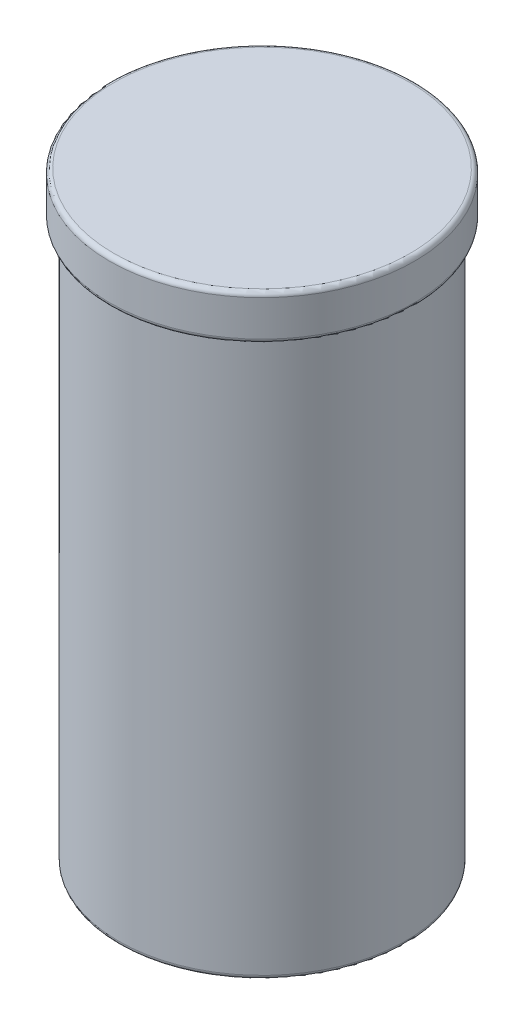
ISO-10303-21;
HEADER;
FILE_DESCRIPTION(('STEP AP214'),'2;1');
FILE_NAME('part.step','',(''),(''),'','','');
FILE_SCHEMA(('AUTOMOTIVE_DESIGN { 1 0 10303 214 1 1 1 1 }'));
ENDSEC;
DATA;
#1=APPLICATION_CONTEXT('core data for automotive mechanical design processes');
#2=APPLICATION_PROTOCOL_DEFINITION('international standard','automotive_design',2000,#1);
#3=PRODUCT_CONTEXT('',#1,'mechanical');
#4=PRODUCT('Part','Part','',(#3));
#5=PRODUCT_RELATED_PRODUCT_CATEGORY('part','',(#4));
#6=PRODUCT_DEFINITION_FORMATION('','',#4);
#7=PRODUCT_DEFINITION_CONTEXT('part definition',#1,'design');
#8=PRODUCT_DEFINITION('design','',#6,#7);
#9=PRODUCT_DEFINITION_SHAPE('','',#8);
#10=(LENGTH_UNIT() NAMED_UNIT(*) SI_UNIT(.MILLI.,.METRE.));
#11=(NAMED_UNIT(*) PLANE_ANGLE_UNIT() SI_UNIT($,.RADIAN.));
#12=(NAMED_UNIT(*) SI_UNIT($,.STERADIAN.) SOLID_ANGLE_UNIT());
#13=UNCERTAINTY_MEASURE_WITH_UNIT(LENGTH_MEASURE(1.E-05),#10,'distance_accuracy_value','');
#14=(GEOMETRIC_REPRESENTATION_CONTEXT(3) GLOBAL_UNCERTAINTY_ASSIGNED_CONTEXT((#13)) GLOBAL_UNIT_ASSIGNED_CONTEXT((#10,
#11,#12)) REPRESENTATION_CONTEXT('',''));
#15=CARTESIAN_POINT('',(0.,0.,0.));
#16=DIRECTION('',(0.,0.,1.));
#17=DIRECTION('',(1.,0.,0.));
#18=AXIS2_PLACEMENT_3D('',#15,#16,#17);
#19=CARTESIAN_POINT('',(0.,67.12,0.));
#20=DIRECTION('',(0.,-1.,0.));
#21=DIRECTION('',(0.,0.,-1.));
#22=AXIS2_PLACEMENT_3D('',#19,#20,#21);
#23=CYLINDRICAL_SURFACE('',#22,16.);
#24=CARTESIAN_POINT('',(0.,0.5,0.));
#25=DIRECTION('',(0.,1.,0.));
#26=DIRECTION('',(0.,0.,1.));
#27=AXIS2_PLACEMENT_3D('',#24,#25,#26);
#28=CIRCLE('',#27,16.);
#29=CARTESIAN_POINT('',(0.,0.5,16.));
#30=VERTEX_POINT('',#29);
#31=EDGE_CURVE('E75',#30,#30,#28,.T.);
#32=ORIENTED_EDGE('',*,*,#31,.T.);
#33=EDGE_LOOP('',(#32));
#34=FACE_BOUND('',#33,.T.);
#35=CARTESIAN_POINT('',(0.,62.12,0.));
#36=DIRECTION('',(0.,1.,0.));
#37=DIRECTION('',(0.,0.,1.));
#38=AXIS2_PLACEMENT_3D('',#35,#36,#37);
#39=CIRCLE('',#38,16.);
#40=CARTESIAN_POINT('',(0.,62.12,16.));
#41=VERTEX_POINT('',#40);
#42=EDGE_CURVE('E79',#41,#41,#39,.T.);
#43=ORIENTED_EDGE('',*,*,#42,.F.);
#44=EDGE_LOOP('',(#43));
#45=FACE_BOUND('',#44,.T.);
#46=ADVANCED_FACE('F47',(#34,#45),#23,.T.);
#47=CARTESIAN_POINT('',(0.,0.,0.));
#48=DIRECTION('',(0.,1.,0.));
#49=DIRECTION('',(0.,0.,1.));
#50=AXIS2_PLACEMENT_3D('',#47,#48,#49);
#51=PLANE('',#50);
#52=CARTESIAN_POINT('',(0.,0.,0.));
#53=DIRECTION('',(0.,1.,0.));
#54=DIRECTION('',(0.,0.,1.));
#55=AXIS2_PLACEMENT_3D('',#52,#53,#54);
#56=CIRCLE('',#55,15.5);
#57=CARTESIAN_POINT('',(0.,0.,15.5));
#58=VERTEX_POINT('',#57);
#59=EDGE_CURVE('E71',#58,#58,#56,.F.);
#60=ORIENTED_EDGE('',*,*,#59,.T.);
#61=EDGE_LOOP('',(#60));
#62=FACE_BOUND('',#61,.T.);
#63=ADVANCED_FACE('F87',(#62),#51,.F.);
#64=CARTESIAN_POINT('',(0.,62.12,0.));
#65=DIRECTION('',(0.,1.,0.));
#66=DIRECTION('',(0.,0.,1.));
#67=AXIS2_PLACEMENT_3D('',#64,#65,#66);
#68=CYLINDRICAL_SURFACE('',#67,17.);
#69=CARTESIAN_POINT('',(0.,62.62,0.));
#70=DIRECTION('',(0.,1.,0.));
#71=DIRECTION('',(0.,0.,1.));
#72=AXIS2_PLACEMENT_3D('',#69,#70,#71);
#73=CIRCLE('',#72,17.);
#74=CARTESIAN_POINT('',(0.,62.62,17.));
#75=VERTEX_POINT('',#74);
#76=EDGE_CURVE('E60',#75,#75,#73,.T.);
#77=ORIENTED_EDGE('',*,*,#76,.T.);
#78=EDGE_LOOP('',(#77));
#79=FACE_BOUND('',#78,.T.);
#80=CARTESIAN_POINT('',(0.,66.62,0.));
#81=DIRECTION('',(0.,1.,0.));
#82=DIRECTION('',(0.,0.,1.));
#83=AXIS2_PLACEMENT_3D('',#80,#81,#82);
#84=CIRCLE('',#83,17.);
#85=CARTESIAN_POINT('',(0.,66.62,17.));
#86=VERTEX_POINT('',#85);
#87=EDGE_CURVE('E65',#86,#86,#84,.F.);
#88=ORIENTED_EDGE('',*,*,#87,.T.);
#89=EDGE_LOOP('',(#88));
#90=FACE_BOUND('',#89,.T.);
#91=ADVANCED_FACE('F93',(#79,#90),#68,.T.);
#92=CARTESIAN_POINT('',(0.,62.12,0.));
#93=DIRECTION('',(0.,1.,0.));
#94=DIRECTION('',(0.,0.,1.));
#95=AXIS2_PLACEMENT_3D('',#92,#93,#94);
#96=PLANE('',#95);
#97=CARTESIAN_POINT('',(0.,62.12,0.));
#98=DIRECTION('',(0.,1.,0.));
#99=DIRECTION('',(0.,0.,1.));
#100=AXIS2_PLACEMENT_3D('',#97,#98,#99);
#101=CIRCLE('',#100,16.5);
#102=CARTESIAN_POINT('',(0.,62.12,16.5));
#103=VERTEX_POINT('',#102);
#104=EDGE_CURVE('E55',#103,#103,#101,.F.);
#105=ORIENTED_EDGE('',*,*,#104,.T.);
#106=EDGE_LOOP('',(#105));
#107=FACE_BOUND('',#106,.T.);
#108=ORIENTED_EDGE('',*,*,#42,.T.);
#109=EDGE_LOOP('',(#108));
#110=FACE_BOUND('',#109,.T.);
#111=ADVANCED_FACE('F84',(#107,#110),#96,.F.);
#112=CARTESIAN_POINT('',(0.,67.12,0.));
#113=DIRECTION('',(0.,1.,0.));
#114=DIRECTION('',(0.,0.,1.));
#115=AXIS2_PLACEMENT_3D('',#112,#113,#114);
#116=PLANE('',#115);
#117=CARTESIAN_POINT('',(0.,67.12,0.));
#118=DIRECTION('',(0.,1.,0.));
#119=DIRECTION('',(0.,0.,1.));
#120=AXIS2_PLACEMENT_3D('',#117,#118,#119);
#121=CIRCLE('',#120,16.5);
#122=CARTESIAN_POINT('',(0.,67.12,16.5));
#123=VERTEX_POINT('',#122);
#124=EDGE_CURVE('E11',#123,#123,#121,.T.);
#125=ORIENTED_EDGE('',*,*,#124,.T.);
#126=EDGE_LOOP('',(#125));
#127=FACE_BOUND('',#126,.T.);
#128=ADVANCED_FACE('F101',(#127),#116,.T.);
#129=CARTESIAN_POINT('',(0.,0.5,0.));
#130=DIRECTION('',(0.,1.,0.));
#131=DIRECTION('',(0.,0.,1.));
#132=AXIS2_PLACEMENT_3D('',#129,#130,#131);
#133=TOROIDAL_SURFACE('',#132,15.5,0.5);
#134=ORIENTED_EDGE('',*,*,#59,.F.);
#135=EDGE_LOOP('',(#134));
#136=FACE_BOUND('',#135,.T.);
#137=ORIENTED_EDGE('',*,*,#31,.F.);
#138=EDGE_LOOP('',(#137));
#139=FACE_BOUND('',#138,.T.);
#140=ADVANCED_FACE('F98',(#136,#139),#133,.T.);
#141=CARTESIAN_POINT('',(0.,62.62,0.));
#142=DIRECTION('',(0.,1.,0.));
#143=DIRECTION('',(0.,0.,1.));
#144=AXIS2_PLACEMENT_3D('',#141,#142,#143);
#145=TOROIDAL_SURFACE('',#144,16.5,0.5);
#146=ORIENTED_EDGE('',*,*,#104,.F.);
#147=EDGE_LOOP('',(#146));
#148=FACE_BOUND('',#147,.T.);
#149=ORIENTED_EDGE('',*,*,#76,.F.);
#150=EDGE_LOOP('',(#149));
#151=FACE_BOUND('',#150,.T.);
#152=ADVANCED_FACE('F100',(#148,#151),#145,.T.);
#153=CARTESIAN_POINT('',(0.,66.62,0.));
#154=DIRECTION('',(0.,1.,0.));
#155=DIRECTION('',(0.,0.,1.));
#156=AXIS2_PLACEMENT_3D('',#153,#154,#155);
#157=TOROIDAL_SURFACE('',#156,16.5,0.5);
#158=ORIENTED_EDGE('',*,*,#87,.F.);
#159=EDGE_LOOP('',(#158));
#160=FACE_BOUND('',#159,.T.);
#161=ORIENTED_EDGE('',*,*,#124,.F.);
#162=EDGE_LOOP('',(#161));
#163=FACE_BOUND('',#162,.T.);
#164=ADVANCED_FACE('F49',(#160,#163),#157,.T.);
#165=CLOSED_SHELL('',(#46,#63,#91,#111,#128,#140,#152,#164));
#166=MANIFOLD_SOLID_BREP('B2',#165);
#167=ADVANCED_BREP_SHAPE_REPRESENTATION('',(#18,#166),#14);
#168=SHAPE_DEFINITION_REPRESENTATION(#9,#167);
ENDSEC;
END-ISO-10303-21;
